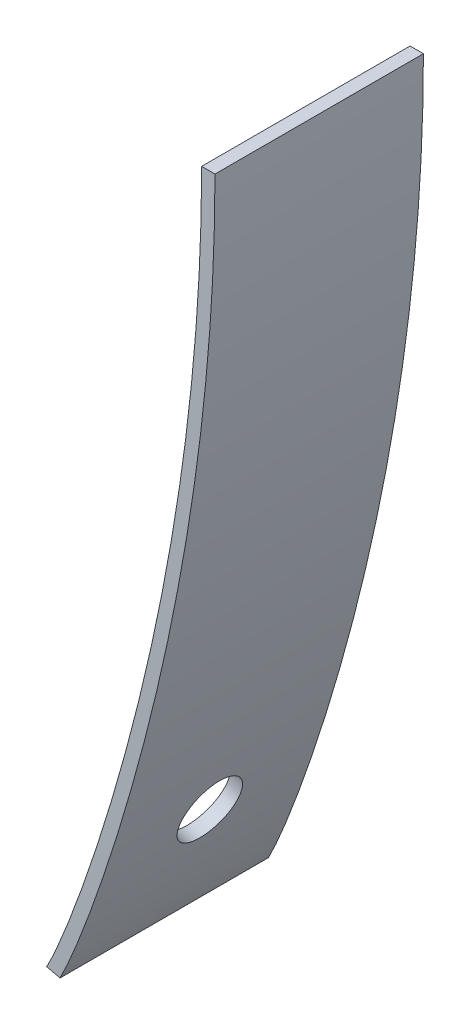
ISO-10303-21;
HEADER;
FILE_DESCRIPTION(('STEP AP214'),'2;1');
FILE_NAME('part.step','',(''),(''),'','','');
FILE_SCHEMA(('AUTOMOTIVE_DESIGN { 1 0 10303 214 1 1 1 1 }'));
ENDSEC;
DATA;
#1=APPLICATION_CONTEXT('core data for automotive mechanical design processes');
#2=APPLICATION_PROTOCOL_DEFINITION('international standard','automotive_design',2000,#1);
#3=PRODUCT_CONTEXT('',#1,'mechanical');
#4=PRODUCT('Part','Part','',(#3));
#5=PRODUCT_RELATED_PRODUCT_CATEGORY('part','',(#4));
#6=PRODUCT_DEFINITION_FORMATION('','',#4);
#7=PRODUCT_DEFINITION_CONTEXT('part definition',#1,'design');
#8=PRODUCT_DEFINITION('design','',#6,#7);
#9=PRODUCT_DEFINITION_SHAPE('','',#8);
#10=(LENGTH_UNIT() NAMED_UNIT(*) SI_UNIT(.MILLI.,.METRE.));
#11=(NAMED_UNIT(*) PLANE_ANGLE_UNIT() SI_UNIT($,.RADIAN.));
#12=(NAMED_UNIT(*) SI_UNIT($,.STERADIAN.) SOLID_ANGLE_UNIT());
#13=UNCERTAINTY_MEASURE_WITH_UNIT(LENGTH_MEASURE(1.E-05),#10,'distance_accuracy_value','');
#14=(GEOMETRIC_REPRESENTATION_CONTEXT(3) GLOBAL_UNCERTAINTY_ASSIGNED_CONTEXT((#13)) GLOBAL_UNIT_ASSIGNED_CONTEXT((#10,
#11,#12)) REPRESENTATION_CONTEXT('',''));
#15=CARTESIAN_POINT('',(0.,0.,0.));
#16=DIRECTION('',(0.,0.,1.));
#17=DIRECTION('',(1.,0.,0.));
#18=AXIS2_PLACEMENT_3D('',#15,#16,#17);
#19=CARTESIAN_POINT('',(-11.800143360472,-29.5747368349658,15.875));
#20=CARTESIAN_POINT('',(-9.59964492780841,-25.4183458450547,15.875));
#21=CARTESIAN_POINT('',(0.,0.,15.875));
#22=CARTESIAN_POINT('',(0.,29.355277438604,15.875));
#23=B_SPLINE_CURVE_WITH_KNOTS('',3,(#19,#20,#21,#22),.UNSPECIFIED.,.F.,.F.,(4,4),(0.,1.),.UNSPECIFIED.);
#24=DIRECTION('',(0.,0.,-1.));
#25=VECTOR('',#24,1.);
#26=SURFACE_OF_LINEAR_EXTRUSION('',#23,#25);
#27=CARTESIAN_POINT('',(-7.59258821113791,-18.4365274515197,7.9375));
#28=CARTESIAN_POINT('',(-7.59258984779441,-18.4365331825427,7.80385718815219));
#29=CARTESIAN_POINT('',(-7.5959871786122,-18.447307102014,7.67011767546013));
#30=CARTESIAN_POINT('',(-7.60950597662681,-18.4901290597936,7.40632499216655));
#31=CARTESIAN_POINT('',(-7.61963551721775,-18.5222026410254,7.27627644332334));
#32=CARTESIAN_POINT('',(-7.64637022890761,-18.6066873701999,7.02372783551718));
#33=CARTESIAN_POINT('',(-7.66297210506219,-18.6590881698704,6.9012239723835));
#34=CARTESIAN_POINT('',(-7.70223911196207,-18.7826958573355,6.66720905562187));
#35=CARTESIAN_POINT('',(-7.72490276293085,-18.8538981553284,6.55569532820508));
#36=CARTESIAN_POINT('',(-7.77575186737003,-19.0131209210168,6.3466932667039));
#37=CARTESIAN_POINT('',(-7.80394149607075,-19.1011541042749,6.24921563499018));
#38=CARTESIAN_POINT('',(-7.86512248613071,-19.2914755547925,6.07113767123));
#39=CARTESIAN_POINT('',(-7.89811406258191,-19.3937644605949,5.99053809559095));
#40=CARTESIAN_POINT('',(-7.96808877423578,-19.6097783794675,5.84842155631316));
#41=CARTESIAN_POINT('',(-8.00507606039122,-19.7235152767747,5.78692469957397));
#42=CARTESIAN_POINT('',(-8.08204288842919,-19.9590825503134,5.6848694153612));
#43=CARTESIAN_POINT('',(-8.12202243449137,-20.0809129378501,5.64431101713543));
#44=CARTESIAN_POINT('',(-8.20391873124702,-20.3292530046912,5.58526958831411));
#45=CARTESIAN_POINT('',(-8.24583640058518,-20.4557648971751,5.56679713992126));
#46=CARTESIAN_POINT('',(-8.33043323180351,-20.709809853028,5.55249250082148));
#47=CARTESIAN_POINT('',(-8.37311239139075,-20.8373429133214,5.55666024195336));
#48=CARTESIAN_POINT('',(-8.45800926481504,-21.0897713340559,5.5875201476363));
#49=CARTESIAN_POINT('',(-8.50022710340809,-21.2146674165871,5.61420606178347));
#50=CARTESIAN_POINT('',(-8.58298271655984,-21.4583183894628,5.68934335400178));
#51=CARTESIAN_POINT('',(-8.62352049469678,-21.5770732928871,5.73779468571359));
#52=CARTESIAN_POINT('',(-8.70167929025533,-21.8050160211101,5.85505654351622));
#53=CARTESIAN_POINT('',(-8.73930202611869,-21.9142094874738,5.92385495780445));
#54=CARTESIAN_POINT('',(-8.81050414792004,-22.1200327699697,6.07987145027578));
#55=CARTESIAN_POINT('',(-8.84408354494134,-22.2166626205404,6.16708947796653));
#56=CARTESIAN_POINT('',(-8.90613281455809,-22.3946073319916,6.35742870305412));
#57=CARTESIAN_POINT('',(-8.93460484799915,-22.4759286703872,6.46054314043106));
#58=CARTESIAN_POINT('',(-8.98554685405469,-22.6210324383565,6.67977522765436));
#59=CARTESIAN_POINT('',(-9.00801683065501,-22.6848148795774,6.79589286886552));
#60=CARTESIAN_POINT('',(-9.04622187622061,-22.7930542799608,7.03781769706379));
#61=CARTESIAN_POINT('',(-9.06195786837486,-22.8375138881812,7.16362355306248));
#62=CARTESIAN_POINT('',(-9.0861817302038,-22.9058834859321,7.4213674997825));
#63=CARTESIAN_POINT('',(-9.09466960047752,-22.9297934771609,7.55330558999702));
#64=CARTESIAN_POINT('',(-9.10411570625203,-22.9563996451794,7.81956862078101));
#65=CARTESIAN_POINT('',(-9.10507394403217,-22.9590958283909,7.95389356062792));
#66=CARTESIAN_POINT('',(-9.09942891134499,-22.9431995533871,8.22111732895997));
#67=CARTESIAN_POINT('',(-9.09282564022728,-22.9246070933408,8.35401615732246));
#68=CARTESIAN_POINT('',(-9.07227678963434,-22.8666496422875,8.61461611221933));
#69=CARTESIAN_POINT('',(-9.05833115406319,-22.8272844925763,8.74231719903476));
#70=CARTESIAN_POINT('',(-9.02355749756425,-22.728876277685,8.9888953731175));
#71=CARTESIAN_POINT('',(-9.0027294795014,-22.6698332206961,9.10777246405795));
#72=CARTESIAN_POINT('',(-8.9548704602647,-22.533715472699,9.33332673353357));
#73=CARTESIAN_POINT('',(-8.92783953617006,-22.4566410057544,9.44000406364206));
#74=CARTESIAN_POINT('',(-8.86844226289544,-22.286613842233,9.63813299218771));
#75=CARTESIAN_POINT('',(-8.83607591410242,-22.1936611468077,9.72958459172915));
#76=CARTESIAN_POINT('',(-8.76702628313691,-21.9944806905354,9.89467008808256));
#77=CARTESIAN_POINT('',(-8.73034290427843,-21.8882526323645,9.96830358572009));
#78=CARTESIAN_POINT('',(-8.65378986326673,-21.6655099172297,10.0956643139758));
#79=CARTESIAN_POINT('',(-8.61392020257674,-21.5489952649897,10.1493915537354));
#80=CARTESIAN_POINT('',(-8.53218432516114,-21.3089386253179,10.2354306806577));
#81=CARTESIAN_POINT('',(-8.49031768438246,-21.1853951442509,10.2677379974639));
#82=CARTESIAN_POINT('',(-8.40582213287254,-20.9347962298676,10.3100099136487));
#83=CARTESIAN_POINT('',(-8.36319321856422,-20.8077407800692,10.3199744081526));
#84=CARTESIAN_POINT('',(-8.27836713558696,-20.5536538201007,10.3172845545445));
#85=CARTESIAN_POINT('',(-8.23617019639023,-20.4266223546051,10.3046187542497));
#86=CARTESIAN_POINT('',(-8.15340177871249,-20.1762576297472,10.2570106943869));
#87=CARTESIAN_POINT('',(-8.11283030991904,-20.0529243924268,10.2220683020749));
#88=CARTESIAN_POINT('',(-8.03438759854383,-19.8134000610055,10.1308729942911));
#89=CARTESIAN_POINT('',(-7.99651793528656,-19.6972131496306,10.0746077339929));
#90=CARTESIAN_POINT('',(-7.92450677868268,-19.475386255444,9.94236500601389));
#91=CARTESIAN_POINT('',(-7.89036514578859,-19.3697458778677,9.86638827653174));
#92=CARTESIAN_POINT('',(-7.82669178044088,-19.1720408999425,9.696875553017));
#93=CARTESIAN_POINT('',(-7.79715992815401,-19.079975946698,9.60334001557254));
#94=CARTESIAN_POINT('',(-7.74344769781134,-18.9120499699398,9.40132743130281));
#95=CARTESIAN_POINT('',(-7.71926863090282,-18.8361929166565,9.29284673424282));
#96=CARTESIAN_POINT('',(-7.67688165554041,-18.7029249836272,9.06408366312897));
#97=CARTESIAN_POINT('',(-7.658672368053,-18.6455098438165,8.94380402301212));
#98=CARTESIAN_POINT('',(-7.62868365472454,-18.5508214837079,8.69492595422597));
#99=CARTESIAN_POINT('',(-7.61689648076722,-18.5135239925264,8.5663377601708));
#100=CARTESIAN_POINT('',(-7.60318094394315,-18.4700971482272,8.35368951414405));
#101=CARTESIAN_POINT('',(-7.59921306246521,-18.4575245907531,8.27101594892244));
#102=CARTESIAN_POINT('',(-7.59391618493897,-18.4407379522743,8.10474088055446));
#103=CARTESIAN_POINT('',(-7.59258718684839,-18.4365238648008,8.0211393781263));
#104=CARTESIAN_POINT('',(-7.59258821113791,-18.4365274515197,7.9375));
#105=B_SPLINE_CURVE_WITH_KNOTS('',3,(#27,#28,#29,#30,#31,#32,#33,#34,#35,#36,#37,#38,#39,#40,
#41,#42,#43,#44,#45,#46,#47,#48,#49,#50,#51,#52,#53,#54,#55,#56,#57,#58,#59,#60,#61,#62,#63,#64,
#65,#66,#67,#68,#69,#70,#71,#72,#73,#74,#75,#76,#77,#78,#79,#80,#81,#82,#83,#84,#85,#86,#87,#88,
#89,#90,#91,#92,#93,#94,#95,#96,#97,#98,#99,#100,#101,#102,#103,#104),.UNSPECIFIED.,.T.,.F.,(4,
2,2,2,2,2,2,2,2,2,2,2,2,2,2,2,2,2,2,2,2,2,2,2,2,2,2,2,2,2,2,2,2,2,2,2,2,2,4),(0.,
0.400622949386984,0.801727202427767,1.20262752691687,1.60343007438366,2.0045366292696,
2.4056611563122,2.80720647439574,3.20875235337476,3.61049055096469,4.0122275390708,
4.41385305309064,4.8154777116709,5.21686377873119,5.61824874551514,6.01946348999652,
6.42067796803972,6.82183742434451,7.22299684749482,7.62415614920712,8.0253154854245,
8.42647788655794,8.82764012069943,9.2287973701452,9.6299545904965,10.03112079704,
10.4322868193579,10.8335384107161,11.2347918855029,11.6362484742913,12.0377074553442,
12.4393992161252,12.8410759356382,13.2427422116505,13.6445067659111,14.0461784460843,
14.447364440427,14.698091582566,14.9488185306641),.UNSPECIFIED.);
#106=CARTESIAN_POINT('',(-7.59258821113791,-18.4365274515197,7.9375));
#107=VERTEX_POINT('',#106);
#108=EDGE_CURVE('E124',#107,#107,#105,.T.);
#109=ORIENTED_EDGE('',*,*,#108,.T.);
#110=EDGE_LOOP('',(#109));
#111=FACE_BOUND('',#110,.T.);
#112=CARTESIAN_POINT('',(-11.800143360472,-29.5747368349658,0.));
#113=CARTESIAN_POINT('',(-9.59964492780841,-25.4183458450547,0.));
#114=CARTESIAN_POINT('',(0.,0.,0.));
#115=CARTESIAN_POINT('',(0.,29.355277438604,0.));
#116=B_SPLINE_CURVE_WITH_KNOTS('',3,(#112,#113,#114,#115),.UNSPECIFIED.,.F.,.F.,(4,4),(0.,1.),.UNSPECIFIED.);
#117=CARTESIAN_POINT('',(-11.800143360472,-29.5747368349658,0.));
#118=VERTEX_POINT('',#117);
#119=CARTESIAN_POINT('',(0.,29.355277438604,0.));
#120=VERTEX_POINT('',#119);
#121=EDGE_CURVE('E118',#118,#120,#116,.T.);
#122=ORIENTED_EDGE('',*,*,#121,.T.);
#123=DIRECTION('',(0.,0.,-1.));
#124=VECTOR('',#123,1.);
#125=CARTESIAN_POINT('',(0.,29.355277438604,15.875));
#126=LINE('',#125,#124);
#127=CARTESIAN_POINT('',(0.,29.355277438604,15.875));
#128=VERTEX_POINT('',#127);
#129=EDGE_CURVE('E11',#128,#120,#126,.T.);
#130=ORIENTED_EDGE('',*,*,#129,.F.);
#131=CARTESIAN_POINT('',(-11.800143360472,-29.5747368349658,15.875));
#132=VERTEX_POINT('',#131);
#133=EDGE_CURVE('E137',#132,#128,#23,.T.);
#134=ORIENTED_EDGE('',*,*,#133,.F.);
#135=DIRECTION('',(0.,0.,-1.));
#136=VECTOR('',#135,1.);
#137=CARTESIAN_POINT('',(-11.800143360472,-29.5747368349658,15.875));
#138=LINE('',#137,#136);
#139=EDGE_CURVE('E111',#132,#118,#138,.T.);
#140=ORIENTED_EDGE('',*,*,#139,.T.);
#141=EDGE_LOOP('',(#122,#130,#134,#140));
#142=FACE_BOUND('',#141,.T.);
#143=ADVANCED_FACE('F33',(#111,#142),#26,.F.);
#144=CARTESIAN_POINT('',(-1.016,29.355277438604,15.875));
#145=DIRECTION('',(0.,-1.,0.));
#146=DIRECTION('',(0.,0.,-1.));
#147=AXIS2_PLACEMENT_3D('',#144,#145,#146);
#148=PLANE('',#147);
#149=DIRECTION('',(-1.,0.,0.));
#150=VECTOR('',#149,1.);
#151=CARTESIAN_POINT('',(-1.016,29.355277438604,0.));
#152=LINE('',#151,#150);
#153=CARTESIAN_POINT('',(-1.016,29.355277438604,0.));
#154=VERTEX_POINT('',#153);
#155=EDGE_CURVE('E123',#120,#154,#152,.T.);
#156=ORIENTED_EDGE('',*,*,#155,.T.);
#157=DIRECTION('',(0.,0.,-1.));
#158=VECTOR('',#157,1.);
#159=CARTESIAN_POINT('',(-1.016,29.355277438604,15.875));
#160=LINE('',#159,#158);
#161=CARTESIAN_POINT('',(-1.016,29.355277438604,15.875));
#162=VERTEX_POINT('',#161);
#163=EDGE_CURVE('E49',#162,#154,#160,.T.);
#164=ORIENTED_EDGE('',*,*,#163,.F.);
#165=DIRECTION('',(-1.,0.,0.));
#166=VECTOR('',#165,1.);
#167=CARTESIAN_POINT('',(-1.016,29.355277438604,15.875));
#168=LINE('',#167,#166);
#169=EDGE_CURVE('E91',#128,#162,#168,.T.);
#170=ORIENTED_EDGE('',*,*,#169,.F.);
#171=ORIENTED_EDGE('',*,*,#129,.T.);
#172=EDGE_LOOP('',(#156,#164,#170,#171));
#173=FACE_BOUND('',#172,.T.);
#174=ADVANCED_FACE('F157',(#173),#148,.F.);
#175=CARTESIAN_POINT('',(-1.016,29.355277438604,15.875));
#176=CARTESIAN_POINT('',(-1.016,27.5503265556302,15.875));
#177=CARTESIAN_POINT('',(-1.09043372835014,23.9151874857523,15.875));
#178=CARTESIAN_POINT('',(-1.50430680819218,16.8553547672985,15.875));
#179=CARTESIAN_POINT('',(-2.45703954484086,8.361518974337,15.875));
#180=CARTESIAN_POINT('',(-4.09942839392137,-1.05647656481716,15.875));
#181=CARTESIAN_POINT('',(-6.04267407602892,-9.50559963624435,15.875));
#182=CARTESIAN_POINT('',(-7.74709774671521,-15.5658438616081,15.875));
#183=CARTESIAN_POINT('',(-9.06189366215089,-19.7231269751213,15.875));
#184=CARTESIAN_POINT('',(-9.99855061732732,-22.4696333687452,15.875));
#185=CARTESIAN_POINT('',(-10.8604888818862,-24.8183732737138,15.875));
#186=CARTESIAN_POINT('',(-11.4952441431381,-26.4218614406249,15.875));
#187=CARTESIAN_POINT('',(-11.939283900297,-27.4773299115762,15.875));
#188=CARTESIAN_POINT('',(-12.2371929515038,-28.1518883900321,15.875));
#189=CARTESIAN_POINT('',(-12.4510605251747,-28.6091685541377,15.875));
#190=CARTESIAN_POINT('',(-12.6023293608155,-28.915317145598,15.875));
#191=CARTESIAN_POINT('',(-12.6643334640127,-29.0356364112078,15.875));
#192=CARTESIAN_POINT('',(-12.6980668679203,-29.0993534373048,15.875));
#193=B_SPLINE_CURVE_WITH_KNOTS('',3,(#175,#176,#177,#178,#179,#180,#181,#182,#183,#184,#185,
#186,#187,#188,#189,#190,#191,#192),.UNSPECIFIED.,.F.,.F.,(4,1,1,1,1,1,1,1,1,1,1,1,1,1,1,4),(0.,
0.0625,0.125,0.25,0.375,0.5,0.625,0.6875,0.75,0.8125,0.875,0.90625,0.9375,0.96875,0.984375,1.),.UNSPECIFIED.);
#194=DIRECTION('',(0.,0.,-1.));
#195=VECTOR('',#194,1.);
#196=SURFACE_OF_LINEAR_EXTRUSION('',#193,#195);
#197=CARTESIAN_POINT('',(-8.54622998850929,-18.0823664860517,7.9375));
#198=CARTESIAN_POINT('',(-8.54623162247811,-18.0823722182411,8.07114122381114));
#199=CARTESIAN_POINT('',(-8.54962519531373,-18.0931472502861,8.20487914495688));
#200=CARTESIAN_POINT('',(-8.56312911802576,-18.1359735673559,8.46866864762882));
#201=CARTESIAN_POINT('',(-8.57324753222614,-18.1680503971247,8.59871560754184));
#202=CARTESIAN_POINT('',(-8.59995314015484,-18.2525434732552,8.8512610542972));
#203=CARTESIAN_POINT('',(-8.61653703966425,-18.3049493617236,8.97376334846198));
#204=CARTESIAN_POINT('',(-8.6557620764937,-18.4285687089115,9.2077753638632));
#205=CARTESIAN_POINT('',(-8.67840173586892,-18.4997775785955,9.3192877581762));
#206=CARTESIAN_POINT('',(-8.72919815346522,-18.6590152912049,9.52828854859061));
#207=CARTESIAN_POINT('',(-8.75735913237303,-18.7470570004451,9.62576611649415));
#208=CARTESIAN_POINT('',(-8.81847931522782,-18.9373964596346,9.80384435644148));
#209=CARTESIAN_POINT('',(-8.85143873448678,-19.0396948492901,9.88444427076809));
#210=CARTESIAN_POINT('',(-8.92134757246166,-19.2557299688009,10.0265631418439));
#211=CARTESIAN_POINT('',(-8.95830119982858,-19.3694787549699,10.088061702237));
#212=CARTESIAN_POINT('',(-9.03520024366265,-19.605070281851,10.190120424594));
#213=CARTESIAN_POINT('',(-9.07514566446636,-19.7269130342951,10.2306805562073));
#214=CARTESIAN_POINT('',(-9.15697491340792,-19.9752788518431,10.2897256689897));
#215=CARTESIAN_POINT('',(-9.1988596751411,-20.1018041651158,10.3081999008289));
#216=CARTESIAN_POINT('',(-9.28339277560696,-20.3558756590891,10.322507648982));
#217=CARTESIAN_POINT('',(-9.32604111203169,-20.4834218367033,10.318341233717));
#218=CARTESIAN_POINT('',(-9.4108792138246,-20.7358753593004,10.2874834376212));
#219=CARTESIAN_POINT('',(-9.45306910451694,-20.8607834347391,10.260798377991));
#220=CARTESIAN_POINT('',(-9.53577246234173,-21.104457301534,10.1856622239078));
#221=CARTESIAN_POINT('',(-9.57628593312028,-21.2232231062495,10.1372111767971));
#222=CARTESIAN_POINT('',(-9.65439977848448,-21.451185250602,10.0199497428976));
#223=CARTESIAN_POINT('',(-9.69200189352828,-21.5603873128091,9.95115164037245));
#224=CARTESIAN_POINT('',(-9.76316688006815,-21.7662263594822,9.79513542168232));
#225=CARTESIAN_POINT('',(-9.79672976278872,-21.8628633788649,9.70791735670582));
#226=CARTESIAN_POINT('',(-9.858749738456,-22.0408203030906,9.5175783596329));
#227=CARTESIAN_POINT('',(-9.88720902521992,-22.1221467900278,9.41446429616336));
#228=CARTESIAN_POINT('',(-9.93812922249503,-22.2672595894021,9.19523281358525));
#229=CARTESIAN_POINT('',(-9.96059013707759,-22.3310459137445,9.07911540330274));
#230=CARTESIAN_POINT('',(-9.9987802939931,-22.4392917568953,8.83719122047569));
#231=CARTESIAN_POINT('',(-10.0145104767252,-22.4837539756275,8.71138580441245));
#232=CARTESIAN_POINT('',(-10.0387256757494,-22.5521278169451,8.45364264252097));
#233=CARTESIAN_POINT('',(-10.047210692653,-22.5760394412648,8.32170489721027));
#234=CARTESIAN_POINT('',(-10.0566538191175,-22.602647953781,8.05544248252316));
#235=CARTESIAN_POINT('',(-10.0576119326017,-22.6053448530355,7.92111781439095));
#236=CARTESIAN_POINT('',(-10.0519693498547,-22.5894490931846,7.65389447888985));
#237=CARTESIAN_POINT('',(-10.0453686529728,-22.5708564322464,7.52099581164372));
#238=CARTESIAN_POINT('',(-10.0248278163421,-22.5128975827286,7.260396052019));
#239=CARTESIAN_POINT('',(-10.0108876198708,-22.473531233602,7.13269499981778));
#240=CARTESIAN_POINT('',(-9.97612803097066,-22.3751194962708,6.88611678128303));
#241=CARTESIAN_POINT('',(-9.95530864143969,-22.316074116356,6.76723961123249));
#242=CARTESIAN_POINT('',(-9.90747045675333,-22.17995047283,6.54168508409901));
#243=CARTESIAN_POINT('',(-9.88045173942662,-22.1028724356074,6.43500757388217));
#244=CARTESIAN_POINT('',(-9.82108278960768,-21.9328367773641,6.23687815907035));
#245=CARTESIAN_POINT('',(-9.78873255753152,-21.8398791575828,6.14542625328714));
#246=CARTESIAN_POINT('',(-9.71971922808847,-21.6406873969968,5.98033993317745));
#247=CARTESIAN_POINT('',(-9.68305603132648,-21.5344529502156,5.90670592959571));
#248=CARTESIAN_POINT('',(-9.60654738891022,-21.3116960957034,5.77934399746723));
#249=CARTESIAN_POINT('',(-9.56670194467294,-21.1951736925534,5.72561606005664));
#250=CARTESIAN_POINT('',(-9.48501805275857,-20.9550998414118,5.63957509619956));
#251=CARTESIAN_POINT('',(-9.44317917424184,-20.8315468727772,5.60726672185957));
#252=CARTESIAN_POINT('',(-9.35874222156265,-20.5809278797784,5.56499248944945));
#253=CARTESIAN_POINT('',(-9.31614414380338,-20.453861838769,5.55502673725876));
#254=CARTESIAN_POINT('',(-9.23138159243051,-20.1997518272335,5.55771381493208));
#255=CARTESIAN_POINT('',(-9.18921735295665,-20.0727079016262,5.57037827399513));
#256=CARTESIAN_POINT('',(-9.10651540285853,-19.8223177341809,5.61798370628709));
#257=CARTESIAN_POINT('',(-9.06597770201765,-19.6989715145851,5.65292481348539));
#258=CARTESIAN_POINT('',(-8.9876019978107,-19.459420160454,5.7441179929578));
#259=CARTESIAN_POINT('',(-8.9497655945729,-19.3432192640499,5.80038257386051));
#260=CARTESIAN_POINT('',(-8.87781931724764,-19.1213649237707,5.93262442982436));
#261=CARTESIAN_POINT('',(-8.84370930374883,-19.0157110853228,6.00860096706445));
#262=CARTESIAN_POINT('',(-8.78009612118959,-18.8179802774477,6.17811390780359));
#263=CARTESIAN_POINT('',(-8.75059283354583,-18.7259029585459,6.27164985916313));
#264=CARTESIAN_POINT('',(-8.69693339662322,-18.5579540147012,6.47366392730498));
#265=CARTESIAN_POINT('',(-8.67277855712424,-18.4820863594972,6.5821456936356));
#266=CARTESIAN_POINT('',(-8.63043479932212,-18.3488003355147,6.81091033345359));
#267=CARTESIAN_POINT('',(-8.61224444002198,-18.2913775105999,6.93119034739022));
#268=CARTESIAN_POINT('',(-8.58228711068906,-18.1966763156255,7.1800695389678));
#269=CARTESIAN_POINT('',(-8.57051239974058,-18.159373669753,7.30865848073348));
#270=CARTESIAN_POINT('',(-8.5568114211222,-18.1159408292215,7.5213080156025));
#271=CARTESIAN_POINT('',(-8.55284776924259,-18.1033665346436,7.60398204557375));
#272=CARTESIAN_POINT('',(-8.54755654265737,-18.0865775725816,7.77025809228588));
#273=CARTESIAN_POINT('',(-8.54622896588339,-18.0823628985382,7.85386010829857));
#274=CARTESIAN_POINT('',(-8.54622998850929,-18.0823664860517,7.9375));
#275=B_SPLINE_CURVE_WITH_KNOTS('',3,(#197,#198,#199,#200,#201,#202,#203,#204,#205,#206,#207,
#208,#209,#210,#211,#212,#213,#214,#215,#216,#217,#218,#219,#220,#221,#222,#223,#224,#225,#226,
#227,#228,#229,#230,#231,#232,#233,#234,#235,#236,#237,#238,#239,#240,#241,#242,#243,#244,#245,
#246,#247,#248,#249,#250,#251,#252,#253,#254,#255,#256,#257,#258,#259,#260,#261,#262,#263,#264,
#265,#266,#267,#268,#269,#270,#271,#272,#273,#274),.UNSPECIFIED.,.T.,.F.,(4,2,2,2,2,2,2,2,2,2,2,
2,2,2,2,2,2,2,2,2,2,2,2,2,2,2,2,2,2,2,2,2,2,2,2,2,2,2,4),(0.,0.40061818058093,0.801717645103406,
1.20261301260954,1.60341062830755,2.00451583054333,2.40563903641773,2.80718909927326,
3.20873974417996,3.61048574654709,4.01223053482042,4.41386258695804,4.81549376553078,
5.21688295790783,5.61827103485157,6.01948615650572,6.42070100583561,6.82185978022529,
7.22301852075871,7.62417705219359,8.0253356181629,8.42649728448408,8.82765878181651,
9.22881524309269,9.62997167306207,10.0311373497544,10.4323028478141,10.8335554463321,
11.2348099463414,11.636270702068,12.0377338721598,12.4394329112405,12.8411169168435,
13.2427905808538,13.6445625020842,14.0462372850183,14.4474263407223,14.6981550198928,
14.9488835023315),.UNSPECIFIED.);
#276=CARTESIAN_POINT('',(-8.54622998850929,-18.0823664860517,7.9375));
#277=VERTEX_POINT('',#276);
#278=EDGE_CURVE('E38',#277,#277,#275,.T.);
#279=ORIENTED_EDGE('',*,*,#278,.T.);
#280=EDGE_LOOP('',(#279));
#281=FACE_BOUND('',#280,.T.);
#282=CARTESIAN_POINT('',(-1.016,29.355277438604,0.));
#283=CARTESIAN_POINT('',(-1.016,27.5503265556302,0.));
#284=CARTESIAN_POINT('',(-1.09043372835014,23.9151874857523,0.));
#285=CARTESIAN_POINT('',(-1.50430680819218,16.8553547672985,0.));
#286=CARTESIAN_POINT('',(-2.45703954484086,8.361518974337,0.));
#287=CARTESIAN_POINT('',(-4.09942839392137,-1.05647656481716,0.));
#288=CARTESIAN_POINT('',(-6.04267407602892,-9.50559963624435,0.));
#289=CARTESIAN_POINT('',(-7.74709774671521,-15.5658438616081,0.));
#290=CARTESIAN_POINT('',(-9.06189366215089,-19.7231269751213,0.));
#291=CARTESIAN_POINT('',(-9.99855061732732,-22.4696333687452,0.));
#292=CARTESIAN_POINT('',(-10.8604888818862,-24.8183732737138,0.));
#293=CARTESIAN_POINT('',(-11.4952441431381,-26.4218614406249,0.));
#294=CARTESIAN_POINT('',(-11.939283900297,-27.4773299115762,0.));
#295=CARTESIAN_POINT('',(-12.2371929515038,-28.1518883900321,0.));
#296=CARTESIAN_POINT('',(-12.4510605251747,-28.6091685541377,0.));
#297=CARTESIAN_POINT('',(-12.6023293608155,-28.915317145598,0.));
#298=CARTESIAN_POINT('',(-12.6643334640127,-29.0356364112078,0.));
#299=CARTESIAN_POINT('',(-12.6980668679203,-29.0993534373048,0.));
#300=B_SPLINE_CURVE_WITH_KNOTS('',3,(#282,#283,#284,#285,#286,#287,#288,#289,#290,#291,#292,
#293,#294,#295,#296,#297,#298,#299),.UNSPECIFIED.,.F.,.F.,(4,1,1,1,1,1,1,1,1,1,1,1,1,1,1,4),(0.,
0.0625,0.125,0.25,0.375,0.5,0.625,0.6875,0.75,0.8125,0.875,0.90625,0.9375,0.96875,0.984375,1.),.UNSPECIFIED.);
#301=CARTESIAN_POINT('',(-12.6980668679203,-29.0993534373048,0.));
#302=VERTEX_POINT('',#301);
#303=EDGE_CURVE('E106',#154,#302,#300,.T.);
#304=ORIENTED_EDGE('',*,*,#303,.T.);
#305=DIRECTION('',(0.,0.,-1.));
#306=VECTOR('',#305,1.);
#307=CARTESIAN_POINT('',(-12.6980668679203,-29.0993534373048,15.875));
#308=LINE('',#307,#306);
#309=CARTESIAN_POINT('',(-12.6980668679203,-29.0993534373048,15.875));
#310=VERTEX_POINT('',#309);
#311=EDGE_CURVE('E103',#310,#302,#308,.T.);
#312=ORIENTED_EDGE('',*,*,#311,.F.);
#313=EDGE_CURVE('E95',#162,#310,#193,.T.);
#314=ORIENTED_EDGE('',*,*,#313,.F.);
#315=ORIENTED_EDGE('',*,*,#163,.T.);
#316=EDGE_LOOP('',(#304,#312,#314,#315));
#317=FACE_BOUND('',#316,.T.);
#318=ADVANCED_FACE('F104',(#281,#317),#196,.F.);
#319=CARTESIAN_POINT('',(-12.8239068603568,-29.3370451361353,15.875));
#320=DIRECTION('',(0.88378297977194,-0.467897044941973,0.));
#321=DIRECTION('',(0.467897044941973,0.88378297977194,0.));
#322=AXIS2_PLACEMENT_3D('',#319,#320,#321);
#323=PLANE('',#322);
#324=DIRECTION('',(-0.467897044941973,-0.88378297977194,0.));
#325=VECTOR('',#324,1.);
#326=CARTESIAN_POINT('',(-12.8239068603568,-29.3370451361353,0.));
#327=LINE('',#326,#325);
#328=CARTESIAN_POINT('',(-12.8239068603568,-29.3370451361353,0.));
#329=VERTEX_POINT('',#328);
#330=EDGE_CURVE('E77',#302,#329,#327,.T.);
#331=ORIENTED_EDGE('',*,*,#330,.T.);
#332=DIRECTION('',(0.,0.,-1.));
#333=VECTOR('',#332,1.);
#334=CARTESIAN_POINT('',(-12.8239068603568,-29.3370451361353,15.875));
#335=LINE('',#334,#333);
#336=CARTESIAN_POINT('',(-12.8239068603568,-29.3370451361353,15.875));
#337=VERTEX_POINT('',#336);
#338=EDGE_CURVE('E107',#337,#329,#335,.T.);
#339=ORIENTED_EDGE('',*,*,#338,.F.);
#340=DIRECTION('',(-0.467897044941973,-0.88378297977194,0.));
#341=VECTOR('',#340,1.);
#342=CARTESIAN_POINT('',(-12.8239068603568,-29.3370451361353,15.875));
#343=LINE('',#342,#341);
#344=EDGE_CURVE('E99',#310,#337,#343,.T.);
#345=ORIENTED_EDGE('',*,*,#344,.F.);
#346=ORIENTED_EDGE('',*,*,#311,.T.);
#347=EDGE_LOOP('',(#331,#339,#345,#346));
#348=FACE_BOUND('',#347,.T.);
#349=ADVANCED_FACE('F109',(#348),#323,.F.);
#350=CARTESIAN_POINT('',(-11.800143360472,-29.5747368349658,15.875));
#351=DIRECTION('',(0.226158881866904,0.974090427092224,0.));
#352=DIRECTION('',(-0.974090427092224,0.226158881866904,0.));
#353=AXIS2_PLACEMENT_3D('',#350,#351,#352);
#354=PLANE('',#353);
#355=DIRECTION('',(0.974090427092224,-0.226158881866904,0.));
#356=VECTOR('',#355,1.);
#357=CARTESIAN_POINT('',(-11.800143360472,-29.5747368349658,0.));
#358=LINE('',#357,#356);
#359=EDGE_CURVE('E83',#329,#118,#358,.T.);
#360=ORIENTED_EDGE('',*,*,#359,.T.);
#361=ORIENTED_EDGE('',*,*,#139,.F.);
#362=DIRECTION('',(0.974090427092224,-0.226158881866904,0.));
#363=VECTOR('',#362,1.);
#364=CARTESIAN_POINT('',(-11.800143360472,-29.5747368349658,15.875));
#365=LINE('',#364,#363);
#366=EDGE_CURVE('E57',#337,#132,#365,.T.);
#367=ORIENTED_EDGE('',*,*,#366,.F.);
#368=ORIENTED_EDGE('',*,*,#338,.T.);
#369=EDGE_LOOP('',(#360,#361,#367,#368));
#370=FACE_BOUND('',#369,.T.);
#371=ADVANCED_FACE('F146',(#370),#354,.F.);
#372=CARTESIAN_POINT('',(-5.07488476798715,-9.55931211644073,15.875));
#373=DIRECTION('',(0.,0.,1.));
#374=DIRECTION('',(1.,0.,0.));
#375=AXIS2_PLACEMENT_3D('',#372,#373,#374);
#376=PLANE('',#375);
#377=ORIENTED_EDGE('',*,*,#133,.T.);
#378=ORIENTED_EDGE('',*,*,#169,.T.);
#379=ORIENTED_EDGE('',*,*,#313,.T.);
#380=ORIENTED_EDGE('',*,*,#344,.T.);
#381=ORIENTED_EDGE('',*,*,#366,.T.);
#382=EDGE_LOOP('',(#377,#378,#379,#380,#381));
#383=FACE_BOUND('',#382,.T.);
#384=ADVANCED_FACE('F97',(#383),#376,.T.);
#385=CARTESIAN_POINT('',(-5.07488476798715,-9.55931211644073,0.));
#386=DIRECTION('',(0.,0.,1.));
#387=DIRECTION('',(1.,0.,0.));
#388=AXIS2_PLACEMENT_3D('',#385,#386,#387);
#389=PLANE('',#388);
#390=ORIENTED_EDGE('',*,*,#121,.F.);
#391=ORIENTED_EDGE('',*,*,#359,.F.);
#392=ORIENTED_EDGE('',*,*,#330,.F.);
#393=ORIENTED_EDGE('',*,*,#303,.F.);
#394=ORIENTED_EDGE('',*,*,#155,.F.);
#395=EDGE_LOOP('',(#390,#391,#392,#393,#394));
#396=FACE_BOUND('',#395,.T.);
#397=ADVANCED_FACE('F142',(#396),#389,.F.);
#398=CARTESIAN_POINT('',(-28.6164271920874,-13.1689096592695,7.9375));
#399=DIRECTION('',(0.937440940778794,-0.348144341547826,0.));
#400=DIRECTION('',(0.348144341547826,0.937440940778794,0.));
#401=AXIS2_PLACEMENT_3D('',#398,#399,#400);
#402=CYLINDRICAL_SURFACE('',#401,2.38125);
#403=ORIENTED_EDGE('',*,*,#278,.F.);
#404=EDGE_LOOP('',(#403));
#405=FACE_BOUND('',#404,.T.);
#406=ORIENTED_EDGE('',*,*,#108,.F.);
#407=EDGE_LOOP('',(#406));
#408=FACE_BOUND('',#407,.T.);
#409=ADVANCED_FACE('F173',(#405,#408),#402,.F.);
#410=CLOSED_SHELL('',(#143,#174,#318,#349,#371,#384,#397,#409));
#411=MANIFOLD_SOLID_BREP('B2',#410);
#412=ADVANCED_BREP_SHAPE_REPRESENTATION('',(#18,#411),#14);
#413=SHAPE_DEFINITION_REPRESENTATION(#9,#412);
ENDSEC;
END-ISO-10303-21;
